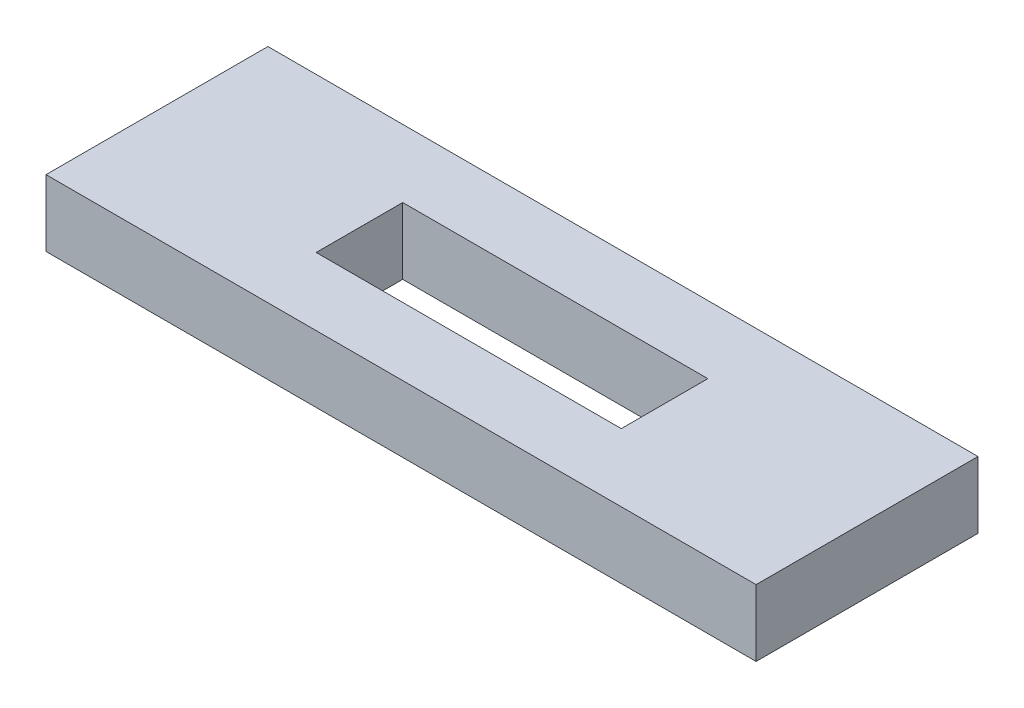
ISO-10303-21;
HEADER;
FILE_DESCRIPTION(('STEP AP214'),'2;1');
FILE_NAME('part.step','',(''),(''),'','','');
FILE_SCHEMA(('AUTOMOTIVE_DESIGN { 1 0 10303 214 1 1 1 1 }'));
ENDSEC;
DATA;
#1=APPLICATION_CONTEXT('core data for automotive mechanical design processes');
#2=APPLICATION_PROTOCOL_DEFINITION('international standard','automotive_design',2000,#1);
#3=PRODUCT_CONTEXT('',#1,'mechanical');
#4=PRODUCT('Part','Part','',(#3));
#5=PRODUCT_RELATED_PRODUCT_CATEGORY('part','',(#4));
#6=PRODUCT_DEFINITION_FORMATION('','',#4);
#7=PRODUCT_DEFINITION_CONTEXT('part definition',#1,'design');
#8=PRODUCT_DEFINITION('design','',#6,#7);
#9=PRODUCT_DEFINITION_SHAPE('','',#8);
#10=(LENGTH_UNIT() NAMED_UNIT(*) SI_UNIT(.MILLI.,.METRE.));
#11=(NAMED_UNIT(*) PLANE_ANGLE_UNIT() SI_UNIT($,.RADIAN.));
#12=(NAMED_UNIT(*) SI_UNIT($,.STERADIAN.) SOLID_ANGLE_UNIT());
#13=UNCERTAINTY_MEASURE_WITH_UNIT(LENGTH_MEASURE(1.E-05),#10,'distance_accuracy_value','');
#14=(GEOMETRIC_REPRESENTATION_CONTEXT(3) GLOBAL_UNCERTAINTY_ASSIGNED_CONTEXT((#13)) GLOBAL_UNIT_ASSIGNED_CONTEXT((#10,
#11,#12)) REPRESENTATION_CONTEXT('',''));
#15=CARTESIAN_POINT('',(0.,0.,0.));
#16=DIRECTION('',(0.,0.,1.));
#17=DIRECTION('',(1.,0.,0.));
#18=AXIS2_PLACEMENT_3D('',#15,#16,#17);
#19=CARTESIAN_POINT('',(16.,3.,5.));
#20=DIRECTION('',(-1.,0.,0.));
#21=DIRECTION('',(0.,0.,1.));
#22=AXIS2_PLACEMENT_3D('',#19,#20,#21);
#23=PLANE('',#22);
#24=DIRECTION('',(0.,0.,-1.));
#25=VECTOR('',#24,1.);
#26=CARTESIAN_POINT('',(16.,0.,5.));
#27=LINE('',#26,#25);
#28=CARTESIAN_POINT('',(16.,0.,5.));
#29=VERTEX_POINT('',#28);
#30=CARTESIAN_POINT('',(16.,0.,-5.));
#31=VERTEX_POINT('',#30);
#32=EDGE_CURVE('E130',#29,#31,#27,.T.);
#33=ORIENTED_EDGE('',*,*,#32,.T.);
#34=DIRECTION('',(0.,-1.,0.));
#35=VECTOR('',#34,1.);
#36=CARTESIAN_POINT('',(16.,3.,-5.));
#37=LINE('',#36,#35);
#38=CARTESIAN_POINT('',(16.,3.,-5.));
#39=VERTEX_POINT('',#38);
#40=EDGE_CURVE('E11',#39,#31,#37,.T.);
#41=ORIENTED_EDGE('',*,*,#40,.F.);
#42=DIRECTION('',(0.,0.,-1.));
#43=VECTOR('',#42,1.);
#44=CARTESIAN_POINT('',(16.,3.,5.));
#45=LINE('',#44,#43);
#46=CARTESIAN_POINT('',(16.,3.,5.));
#47=VERTEX_POINT('',#46);
#48=EDGE_CURVE('E134',#47,#39,#45,.T.);
#49=ORIENTED_EDGE('',*,*,#48,.F.);
#50=DIRECTION('',(0.,-1.,0.));
#51=VECTOR('',#50,1.);
#52=CARTESIAN_POINT('',(16.,3.,5.));
#53=LINE('',#52,#51);
#54=EDGE_CURVE('E144',#47,#29,#53,.T.);
#55=ORIENTED_EDGE('',*,*,#54,.T.);
#56=EDGE_LOOP('',(#33,#41,#49,#55));
#57=FACE_BOUND('',#56,.T.);
#58=ADVANCED_FACE('F33',(#57),#23,.F.);
#59=CARTESIAN_POINT('',(-16.,3.,-5.));
#60=DIRECTION('',(0.,0.,1.));
#61=DIRECTION('',(1.,0.,0.));
#62=AXIS2_PLACEMENT_3D('',#59,#60,#61);
#63=PLANE('',#62);
#64=DIRECTION('',(-1.,0.,0.));
#65=VECTOR('',#64,1.);
#66=CARTESIAN_POINT('',(-16.,0.,-5.));
#67=LINE('',#66,#65);
#68=CARTESIAN_POINT('',(-16.,0.,-5.));
#69=VERTEX_POINT('',#68);
#70=EDGE_CURVE('E147',#31,#69,#67,.T.);
#71=ORIENTED_EDGE('',*,*,#70,.T.);
#72=DIRECTION('',(0.,-1.,0.));
#73=VECTOR('',#72,1.);
#74=CARTESIAN_POINT('',(-16.,3.,-5.));
#75=LINE('',#74,#73);
#76=CARTESIAN_POINT('',(-16.,3.,-5.));
#77=VERTEX_POINT('',#76);
#78=EDGE_CURVE('E40',#77,#69,#75,.T.);
#79=ORIENTED_EDGE('',*,*,#78,.F.);
#80=DIRECTION('',(-1.,0.,0.));
#81=VECTOR('',#80,1.);
#82=CARTESIAN_POINT('',(-16.,3.,-5.));
#83=LINE('',#82,#81);
#84=EDGE_CURVE('E137',#39,#77,#83,.T.);
#85=ORIENTED_EDGE('',*,*,#84,.F.);
#86=ORIENTED_EDGE('',*,*,#40,.T.);
#87=EDGE_LOOP('',(#71,#79,#85,#86));
#88=FACE_BOUND('',#87,.T.);
#89=ADVANCED_FACE('F175',(#88),#63,.F.);
#90=CARTESIAN_POINT('',(-16.,3.,5.));
#91=DIRECTION('',(1.,0.,0.));
#92=DIRECTION('',(0.,0.,-1.));
#93=AXIS2_PLACEMENT_3D('',#90,#91,#92);
#94=PLANE('',#93);
#95=DIRECTION('',(0.,0.,1.));
#96=VECTOR('',#95,1.);
#97=CARTESIAN_POINT('',(-16.,0.,5.));
#98=LINE('',#97,#96);
#99=CARTESIAN_POINT('',(-16.,0.,5.));
#100=VERTEX_POINT('',#99);
#101=EDGE_CURVE('E149',#69,#100,#98,.T.);
#102=ORIENTED_EDGE('',*,*,#101,.T.);
#103=DIRECTION('',(0.,-1.,0.));
#104=VECTOR('',#103,1.);
#105=CARTESIAN_POINT('',(-16.,3.,5.));
#106=LINE('',#105,#104);
#107=CARTESIAN_POINT('',(-16.,3.,5.));
#108=VERTEX_POINT('',#107);
#109=EDGE_CURVE('E154',#108,#100,#106,.T.);
#110=ORIENTED_EDGE('',*,*,#109,.F.);
#111=DIRECTION('',(0.,0.,1.));
#112=VECTOR('',#111,1.);
#113=CARTESIAN_POINT('',(-16.,3.,5.));
#114=LINE('',#113,#112);
#115=EDGE_CURVE('E140',#77,#108,#114,.T.);
#116=ORIENTED_EDGE('',*,*,#115,.F.);
#117=ORIENTED_EDGE('',*,*,#78,.T.);
#118=EDGE_LOOP('',(#102,#110,#116,#117));
#119=FACE_BOUND('',#118,.T.);
#120=ADVANCED_FACE('F161',(#119),#94,.F.);
#121=CARTESIAN_POINT('',(-16.,3.,5.));
#122=DIRECTION('',(0.,0.,-1.));
#123=DIRECTION('',(-1.,0.,0.));
#124=AXIS2_PLACEMENT_3D('',#121,#122,#123);
#125=PLANE('',#124);
#126=DIRECTION('',(1.,0.,0.));
#127=VECTOR('',#126,1.);
#128=CARTESIAN_POINT('',(-16.,0.,5.));
#129=LINE('',#128,#127);
#130=EDGE_CURVE('E138',#100,#29,#129,.T.);
#131=ORIENTED_EDGE('',*,*,#130,.T.);
#132=ORIENTED_EDGE('',*,*,#54,.F.);
#133=DIRECTION('',(1.,0.,0.));
#134=VECTOR('',#133,1.);
#135=CARTESIAN_POINT('',(-16.,3.,5.));
#136=LINE('',#135,#134);
#137=EDGE_CURVE('E142',#108,#47,#136,.T.);
#138=ORIENTED_EDGE('',*,*,#137,.F.);
#139=ORIENTED_EDGE('',*,*,#109,.T.);
#140=EDGE_LOOP('',(#131,#132,#138,#139));
#141=FACE_BOUND('',#140,.T.);
#142=ADVANCED_FACE('F168',(#141),#125,.F.);
#143=CARTESIAN_POINT('',(0.,3.,0.));
#144=DIRECTION('',(0.,-1.,0.));
#145=DIRECTION('',(0.,0.,-1.));
#146=AXIS2_PLACEMENT_3D('',#143,#144,#145);
#147=PLANE('',#146);
#148=DIRECTION('',(-1.,0.,0.));
#149=VECTOR('',#148,1.);
#150=CARTESIAN_POINT('',(-6.875,3.,-1.95));
#151=LINE('',#150,#149);
#152=CARTESIAN_POINT('',(6.875,3.,-1.95));
#153=VERTEX_POINT('',#152);
#154=CARTESIAN_POINT('',(-6.875,3.,-1.95));
#155=VERTEX_POINT('',#154);
#156=EDGE_CURVE('E124',#153,#155,#151,.T.);
#157=ORIENTED_EDGE('',*,*,#156,.F.);
#158=DIRECTION('',(0.,0.,-1.));
#159=VECTOR('',#158,1.);
#160=CARTESIAN_POINT('',(6.875,3.,1.95));
#161=LINE('',#160,#159);
#162=CARTESIAN_POINT('',(6.875,3.,1.95));
#163=VERTEX_POINT('',#162);
#164=EDGE_CURVE('E47',#163,#153,#161,.T.);
#165=ORIENTED_EDGE('',*,*,#164,.F.);
#166=DIRECTION('',(1.,0.,0.));
#167=VECTOR('',#166,1.);
#168=CARTESIAN_POINT('',(-6.875,3.,1.95));
#169=LINE('',#168,#167);
#170=CARTESIAN_POINT('',(-6.875,3.,1.95));
#171=VERTEX_POINT('',#170);
#172=EDGE_CURVE('E115',#171,#163,#169,.T.);
#173=ORIENTED_EDGE('',*,*,#172,.F.);
#174=DIRECTION('',(0.,0.,1.));
#175=VECTOR('',#174,1.);
#176=CARTESIAN_POINT('',(-6.875,3.,1.95));
#177=LINE('',#176,#175);
#178=EDGE_CURVE('E118',#155,#171,#177,.T.);
#179=ORIENTED_EDGE('',*,*,#178,.F.);
#180=EDGE_LOOP('',(#157,#165,#173,#179));
#181=FACE_BOUND('',#180,.T.);
#182=ORIENTED_EDGE('',*,*,#48,.T.);
#183=ORIENTED_EDGE('',*,*,#84,.T.);
#184=ORIENTED_EDGE('',*,*,#115,.T.);
#185=ORIENTED_EDGE('',*,*,#137,.T.);
#186=EDGE_LOOP('',(#182,#183,#184,#185));
#187=FACE_BOUND('',#186,.T.);
#188=ADVANCED_FACE('F174',(#181,#187),#147,.F.);
#189=CARTESIAN_POINT('',(0.,0.,0.));
#190=DIRECTION('',(0.,-1.,0.));
#191=DIRECTION('',(0.,0.,-1.));
#192=AXIS2_PLACEMENT_3D('',#189,#190,#191);
#193=PLANE('',#192);
#194=DIRECTION('',(0.,0.,-1.));
#195=VECTOR('',#194,1.);
#196=CARTESIAN_POINT('',(6.875,0.,1.95));
#197=LINE('',#196,#195);
#198=CARTESIAN_POINT('',(6.875,0.,1.95));
#199=VERTEX_POINT('',#198);
#200=CARTESIAN_POINT('',(6.875,0.,-1.95));
#201=VERTEX_POINT('',#200);
#202=EDGE_CURVE('E99',#199,#201,#197,.T.);
#203=ORIENTED_EDGE('',*,*,#202,.T.);
#204=DIRECTION('',(-1.,0.,0.));
#205=VECTOR('',#204,1.);
#206=CARTESIAN_POINT('',(-6.875,0.,-1.95));
#207=LINE('',#206,#205);
#208=CARTESIAN_POINT('',(-6.875,0.,-1.95));
#209=VERTEX_POINT('',#208);
#210=EDGE_CURVE('E108',#201,#209,#207,.T.);
#211=ORIENTED_EDGE('',*,*,#210,.T.);
#212=DIRECTION('',(0.,0.,1.));
#213=VECTOR('',#212,1.);
#214=CARTESIAN_POINT('',(-6.875,0.,1.95));
#215=LINE('',#214,#213);
#216=CARTESIAN_POINT('',(-6.875,0.,1.95));
#217=VERTEX_POINT('',#216);
#218=EDGE_CURVE('E55',#209,#217,#215,.T.);
#219=ORIENTED_EDGE('',*,*,#218,.T.);
#220=DIRECTION('',(1.,0.,0.));
#221=VECTOR('',#220,1.);
#222=CARTESIAN_POINT('',(-6.875,0.,1.95));
#223=LINE('',#222,#221);
#224=EDGE_CURVE('E105',#217,#199,#223,.T.);
#225=ORIENTED_EDGE('',*,*,#224,.T.);
#226=EDGE_LOOP('',(#203,#211,#219,#225));
#227=FACE_BOUND('',#226,.T.);
#228=ORIENTED_EDGE('',*,*,#32,.F.);
#229=ORIENTED_EDGE('',*,*,#130,.F.);
#230=ORIENTED_EDGE('',*,*,#101,.F.);
#231=ORIENTED_EDGE('',*,*,#70,.F.);
#232=EDGE_LOOP('',(#228,#229,#230,#231));
#233=FACE_BOUND('',#232,.T.);
#234=ADVANCED_FACE('F112',(#227,#233),#193,.T.);
#235=CARTESIAN_POINT('',(6.875,0.,1.95));
#236=DIRECTION('',(1.,0.,0.));
#237=DIRECTION('',(0.,0.,-1.));
#238=AXIS2_PLACEMENT_3D('',#235,#236,#237);
#239=PLANE('',#238);
#240=ORIENTED_EDGE('',*,*,#164,.T.);
#241=DIRECTION('',(0.,1.,0.));
#242=VECTOR('',#241,1.);
#243=CARTESIAN_POINT('',(6.875,0.,-1.95));
#244=LINE('',#243,#242);
#245=EDGE_CURVE('E95',#201,#153,#244,.T.);
#246=ORIENTED_EDGE('',*,*,#245,.F.);
#247=ORIENTED_EDGE('',*,*,#202,.F.);
#248=DIRECTION('',(0.,1.,0.));
#249=VECTOR('',#248,1.);
#250=CARTESIAN_POINT('',(6.875,0.,1.95));
#251=LINE('',#250,#249);
#252=EDGE_CURVE('E128',#199,#163,#251,.T.);
#253=ORIENTED_EDGE('',*,*,#252,.T.);
#254=EDGE_LOOP('',(#240,#246,#247,#253));
#255=FACE_BOUND('',#254,.T.);
#256=ADVANCED_FACE('F97',(#255),#239,.F.);
#257=CARTESIAN_POINT('',(-6.875,0.,1.95));
#258=DIRECTION('',(0.,0.,1.));
#259=DIRECTION('',(1.,0.,0.));
#260=AXIS2_PLACEMENT_3D('',#257,#258,#259);
#261=PLANE('',#260);
#262=ORIENTED_EDGE('',*,*,#172,.T.);
#263=ORIENTED_EDGE('',*,*,#252,.F.);
#264=ORIENTED_EDGE('',*,*,#224,.F.);
#265=DIRECTION('',(0.,1.,0.));
#266=VECTOR('',#265,1.);
#267=CARTESIAN_POINT('',(-6.875,0.,1.95));
#268=LINE('',#267,#266);
#269=EDGE_CURVE('E131',#217,#171,#268,.T.);
#270=ORIENTED_EDGE('',*,*,#269,.T.);
#271=EDGE_LOOP('',(#262,#263,#264,#270));
#272=FACE_BOUND('',#271,.T.);
#273=ADVANCED_FACE('F192',(#272),#261,.F.);
#274=CARTESIAN_POINT('',(-6.875,0.,1.95));
#275=DIRECTION('',(-1.,0.,0.));
#276=DIRECTION('',(0.,0.,1.));
#277=AXIS2_PLACEMENT_3D('',#274,#275,#276);
#278=PLANE('',#277);
#279=ORIENTED_EDGE('',*,*,#178,.T.);
#280=ORIENTED_EDGE('',*,*,#269,.F.);
#281=ORIENTED_EDGE('',*,*,#218,.F.);
#282=DIRECTION('',(0.,1.,0.));
#283=VECTOR('',#282,1.);
#284=CARTESIAN_POINT('',(-6.875,0.,-1.95));
#285=LINE('',#284,#283);
#286=EDGE_CURVE('E104',#209,#155,#285,.T.);
#287=ORIENTED_EDGE('',*,*,#286,.T.);
#288=EDGE_LOOP('',(#279,#280,#281,#287));
#289=FACE_BOUND('',#288,.T.);
#290=ADVANCED_FACE('F195',(#289),#278,.F.);
#291=CARTESIAN_POINT('',(-6.875,0.,-1.95));
#292=DIRECTION('',(0.,0.,-1.));
#293=DIRECTION('',(-1.,0.,0.));
#294=AXIS2_PLACEMENT_3D('',#291,#292,#293);
#295=PLANE('',#294);
#296=ORIENTED_EDGE('',*,*,#156,.T.);
#297=ORIENTED_EDGE('',*,*,#286,.F.);
#298=ORIENTED_EDGE('',*,*,#210,.F.);
#299=ORIENTED_EDGE('',*,*,#245,.T.);
#300=EDGE_LOOP('',(#296,#297,#298,#299));
#301=FACE_BOUND('',#300,.T.);
#302=ADVANCED_FACE('F109',(#301),#295,.F.);
#303=CLOSED_SHELL('',(#58,#89,#120,#142,#188,#234,#256,#273,#290,#302));
#304=MANIFOLD_SOLID_BREP('B2',#303);
#305=ADVANCED_BREP_SHAPE_REPRESENTATION('',(#18,#304),#14);
#306=SHAPE_DEFINITION_REPRESENTATION(#9,#305);
ENDSEC;
END-ISO-10303-21;
